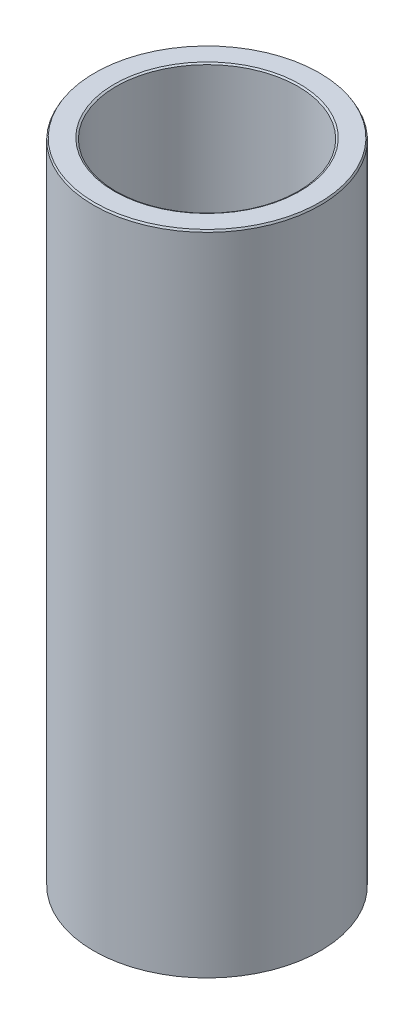
ISO-10303-21;
HEADER;
FILE_DESCRIPTION(('STEP AP214'),'2;1');
FILE_NAME('part.step','',(''),(''),'','','');
FILE_SCHEMA(('AUTOMOTIVE_DESIGN { 1 0 10303 214 1 1 1 1 }'));
ENDSEC;
DATA;
#1=APPLICATION_CONTEXT('core data for automotive mechanical design processes');
#2=APPLICATION_PROTOCOL_DEFINITION('international standard','automotive_design',2000,#1);
#3=PRODUCT_CONTEXT('',#1,'mechanical');
#4=PRODUCT('Part','Part','',(#3));
#5=PRODUCT_RELATED_PRODUCT_CATEGORY('part','',(#4));
#6=PRODUCT_DEFINITION_FORMATION('','',#4);
#7=PRODUCT_DEFINITION_CONTEXT('part definition',#1,'design');
#8=PRODUCT_DEFINITION('design','',#6,#7);
#9=PRODUCT_DEFINITION_SHAPE('','',#8);
#10=(LENGTH_UNIT() NAMED_UNIT(*) SI_UNIT(.MILLI.,.METRE.));
#11=(NAMED_UNIT(*) PLANE_ANGLE_UNIT() SI_UNIT($,.RADIAN.));
#12=(NAMED_UNIT(*) SI_UNIT($,.STERADIAN.) SOLID_ANGLE_UNIT());
#13=UNCERTAINTY_MEASURE_WITH_UNIT(LENGTH_MEASURE(1.E-05),#10,'distance_accuracy_value','');
#14=(GEOMETRIC_REPRESENTATION_CONTEXT(3) GLOBAL_UNCERTAINTY_ASSIGNED_CONTEXT((#13)) GLOBAL_UNIT_ASSIGNED_CONTEXT((#10,
#11,#12)) REPRESENTATION_CONTEXT('',''));
#15=CARTESIAN_POINT('',(0.,0.,0.));
#16=DIRECTION('',(0.,0.,1.));
#17=DIRECTION('',(1.,0.,0.));
#18=AXIS2_PLACEMENT_3D('',#15,#16,#17);
#19=CARTESIAN_POINT('',(0.,228.77688632099,0.));
#20=DIRECTION('',(0.,-1.,0.));
#21=DIRECTION('',(0.,0.,-1.));
#22=AXIS2_PLACEMENT_3D('',#19,#20,#21);
#23=CYLINDRICAL_SURFACE('',#22,40.);
#24=CARTESIAN_POINT('',(0.,0.370162493781384,0.));
#25=DIRECTION('',(0.,1.,0.));
#26=DIRECTION('',(0.,0.,1.));
#27=AXIS2_PLACEMENT_3D('',#24,#25,#26);
#28=CIRCLE('',#27,40.);
#29=CARTESIAN_POINT('',(0.,0.370162493781384,40.));
#30=VERTEX_POINT('',#29);
#31=EDGE_CURVE('E10',#30,#30,#28,.T.);
#32=ORIENTED_EDGE('',*,*,#31,.T.);
#33=EDGE_LOOP('',(#32));
#34=FACE_BOUND('',#33,.T.);
#35=CARTESIAN_POINT('',(0.,228.135746074704,0.));
#36=DIRECTION('',(0.,1.,0.));
#37=DIRECTION('',(0.,0.,1.));
#38=AXIS2_PLACEMENT_3D('',#35,#36,#37);
#39=CIRCLE('',#38,40.);
#40=CARTESIAN_POINT('',(0.,228.135746074704,40.));
#41=VERTEX_POINT('',#40);
#42=EDGE_CURVE('E50',#41,#41,#39,.F.);
#43=ORIENTED_EDGE('',*,*,#42,.T.);
#44=EDGE_LOOP('',(#43));
#45=FACE_BOUND('',#44,.T.);
#46=ADVANCED_FACE('F39',(#34,#45),#23,.T.);
#47=CARTESIAN_POINT('',(0.,228.77688632099,0.));
#48=DIRECTION('',(0.,1.,0.));
#49=DIRECTION('',(0.,0.,1.));
#50=AXIS2_PLACEMENT_3D('',#47,#48,#49);
#51=PLANE('',#50);
#52=CARTESIAN_POINT('',(0.,228.77688632099,0.));
#53=DIRECTION('',(0.,1.,0.));
#54=DIRECTION('',(0.,0.,1.));
#55=AXIS2_PLACEMENT_3D('',#52,#53,#54);
#56=CIRCLE('',#55,32.7370871076893);
#57=CARTESIAN_POINT('',(0.,228.77688632099,32.7370871076893));
#58=VERTEX_POINT('',#57);
#59=EDGE_CURVE('E58',#58,#58,#56,.F.);
#60=ORIENTED_EDGE('',*,*,#59,.T.);
#61=EDGE_LOOP('',(#60));
#62=FACE_BOUND('',#61,.T.);
#63=CARTESIAN_POINT('',(0.,228.77688632099,0.));
#64=DIRECTION('',(0.,1.,0.));
#65=DIRECTION('',(0.,0.,1.));
#66=AXIS2_PLACEMENT_3D('',#63,#64,#65);
#67=CIRCLE('',#66,39.6298375062186);
#68=CARTESIAN_POINT('',(0.,228.77688632099,39.6298375062186));
#69=VERTEX_POINT('',#68);
#70=EDGE_CURVE('E61',#69,#69,#67,.T.);
#71=ORIENTED_EDGE('',*,*,#70,.T.);
#72=EDGE_LOOP('',(#71));
#73=FACE_BOUND('',#72,.T.);
#74=ADVANCED_FACE('F88',(#62,#73),#51,.T.);
#75=CARTESIAN_POINT('',(0.,0.,0.));
#76=DIRECTION('',(0.,1.,0.));
#77=DIRECTION('',(0.,0.,1.));
#78=AXIS2_PLACEMENT_3D('',#75,#76,#77);
#79=PLANE('',#78);
#80=CARTESIAN_POINT('',(0.,0.,0.));
#81=DIRECTION('',(0.,1.,0.));
#82=DIRECTION('',(0.,0.,1.));
#83=AXIS2_PLACEMENT_3D('',#80,#81,#82);
#84=CIRCLE('',#83,32.4661093551849);
#85=CARTESIAN_POINT('',(0.,0.,-32.4661093551849));
#86=VERTEX_POINT('',#85);
#87=EDGE_CURVE('E51',#86,#86,#84,.T.);
#88=ORIENTED_EDGE('',*,*,#87,.T.);
#89=EDGE_LOOP('',(#88));
#90=FACE_BOUND('',#89,.T.);
#91=CARTESIAN_POINT('',(0.,0.,0.));
#92=DIRECTION('',(0.,1.,0.));
#93=DIRECTION('',(0.,0.,1.));
#94=AXIS2_PLACEMENT_3D('',#91,#92,#93);
#95=CIRCLE('',#94,39.3588597537142);
#96=CARTESIAN_POINT('',(0.,0.,39.3588597537142));
#97=VERTEX_POINT('',#96);
#98=EDGE_CURVE('E54',#97,#97,#95,.F.);
#99=ORIENTED_EDGE('',*,*,#98,.T.);
#100=EDGE_LOOP('',(#99));
#101=FACE_BOUND('',#100,.T.);
#102=ADVANCED_FACE('F83',(#90,#101),#79,.F.);
#103=CARTESIAN_POINT('',(0.,228.77688632099,0.));
#104=DIRECTION('',(0.,-1.,0.));
#105=DIRECTION('',(0.,0.,-1.));
#106=AXIS2_PLACEMENT_3D('',#103,#104,#105);
#107=CYLINDRICAL_SURFACE('',#106,32.0959468614035);
#108=CARTESIAN_POINT('',(0.,228.406723827208,0.));
#109=DIRECTION('',(0.,1.,0.));
#110=DIRECTION('',(0.,0.,1.));
#111=AXIS2_PLACEMENT_3D('',#108,#109,#110);
#112=CIRCLE('',#111,32.0959468614035);
#113=CARTESIAN_POINT('',(0.,228.406723827208,32.0959468614035));
#114=VERTEX_POINT('',#113);
#115=EDGE_CURVE('E67',#114,#114,#112,.T.);
#116=ORIENTED_EDGE('',*,*,#115,.T.);
#117=EDGE_LOOP('',(#116));
#118=FACE_BOUND('',#117,.T.);
#119=CARTESIAN_POINT('',(0.,0.64114024628581,0.));
#120=DIRECTION('',(0.,1.,0.));
#121=DIRECTION('',(0.,0.,1.));
#122=AXIS2_PLACEMENT_3D('',#119,#120,#121);
#123=CIRCLE('',#122,32.0959468614035);
#124=CARTESIAN_POINT('',(0.,0.641140246285809,-32.0959468614035));
#125=VERTEX_POINT('',#124);
#126=EDGE_CURVE('E69',#125,#125,#123,.F.);
#127=ORIENTED_EDGE('',*,*,#126,.T.);
#128=EDGE_LOOP('',(#127));
#129=FACE_BOUND('',#128,.T.);
#130=ADVANCED_FACE('F71',(#118,#129),#107,.F.);
#131=CARTESIAN_POINT('',(0.,228.406723827208,0.));
#132=DIRECTION('',(0.,1.,0.));
#133=DIRECTION('',(0.,0.,1.));
#134=AXIS2_PLACEMENT_3D('',#131,#132,#133);
#135=CONICAL_SURFACE('',#134,32.0959468614035,1.04719755119659);
#136=ORIENTED_EDGE('',*,*,#59,.F.);
#137=EDGE_LOOP('',(#136));
#138=FACE_BOUND('',#137,.T.);
#139=ORIENTED_EDGE('',*,*,#115,.F.);
#140=EDGE_LOOP('',(#139));
#141=FACE_BOUND('',#140,.T.);
#142=ADVANCED_FACE('F77',(#138,#141),#135,.F.);
#143=CARTESIAN_POINT('',(0.,0.,0.));
#144=DIRECTION('',(0.,-1.,0.));
#145=DIRECTION('',(0.,0.,-1.));
#146=AXIS2_PLACEMENT_3D('',#143,#144,#145);
#147=CONICAL_SURFACE('',#146,32.4661093551849,0.523598775598303);
#148=CARTESIAN_POINT('',(0.,0.641140246285809,-32.0959468614035));
#149=CARTESIAN_POINT('',(0.,0.634461702053667,-32.0998027207137));
#150=CARTESIAN_POINT('',(0.,0.627783157821523,-32.1036585800239));
#151=CARTESIAN_POINT('',(0.,0.614426069357234,-32.1113702986444));
#152=CARTESIAN_POINT('',(0.,0.60774752512509,-32.1152261579546));
#153=CARTESIAN_POINT('',(0.,0.594390436660802,-32.122937876575));
#154=CARTESIAN_POINT('',(0.,0.587711892428659,-32.1267937358852));
#155=CARTESIAN_POINT('',(0.,0.574354803964371,-32.1345054545057));
#156=CARTESIAN_POINT('',(0.,0.567676259732227,-32.1383613138159));
#157=CARTESIAN_POINT('',(0.,0.554319171267939,-32.1460730324364));
#158=CARTESIAN_POINT('',(0.,0.547640627035796,-32.1499288917466));
#159=CARTESIAN_POINT('',(0.,0.534283538571508,-32.157640610367));
#160=CARTESIAN_POINT('',(0.,0.527604994339364,-32.1614964696772));
#161=CARTESIAN_POINT('',(0.,0.514247905875076,-32.1692081882977));
#162=CARTESIAN_POINT('',(0.,0.507569361642933,-32.1730640476079));
#163=CARTESIAN_POINT('',(0.,0.494212273178645,-32.1807757662284));
#164=CARTESIAN_POINT('',(0.,0.4875337289465,-32.1846316255386));
#165=CARTESIAN_POINT('',(0.,0.474176640482213,-32.192343344159));
#166=CARTESIAN_POINT('',(0.,0.46749809625007,-32.1961992034693));
#167=CARTESIAN_POINT('',(0.,0.454141007785782,-32.2039109220897));
#168=CARTESIAN_POINT('',(0.,0.447462463553637,-32.2077667813999));
#169=CARTESIAN_POINT('',(0.,0.43410537508935,-32.2154785000204));
#170=CARTESIAN_POINT('',(0.,0.427426830857207,-32.2193343593306));
#171=CARTESIAN_POINT('',(0.,0.414069742392919,-32.227046077951));
#172=CARTESIAN_POINT('',(0.,0.407391198160774,-32.2309019372613));
#173=CARTESIAN_POINT('',(0.,0.394034109696487,-32.2386136558817));
#174=CARTESIAN_POINT('',(0.,0.387355565464344,-32.2424695151919));
#175=CARTESIAN_POINT('',(0.,0.373998477000056,-32.2501812338124));
#176=CARTESIAN_POINT('',(0.,0.367319932767911,-32.2540370931226));
#177=CARTESIAN_POINT('',(0.,0.353962844303623,-32.261748811743));
#178=CARTESIAN_POINT('',(0.,0.347284300071481,-32.2656046710533));
#179=CARTESIAN_POINT('',(0.,0.333927211607193,-32.2733163896737));
#180=CARTESIAN_POINT('',(0.,0.327248667375048,-32.2771722489839));
#181=CARTESIAN_POINT('',(0.,0.31389157891076,-32.2848839676044));
#182=CARTESIAN_POINT('',(0.,0.307213034678617,-32.2887398269146));
#183=CARTESIAN_POINT('',(0.,0.29385594621433,-32.2964515455351));
#184=CARTESIAN_POINT('',(0.,0.287177401982186,-32.3003074048453));
#185=CARTESIAN_POINT('',(0.,0.273820313517898,-32.3080191234657));
#186=CARTESIAN_POINT('',(0.,0.267141769285753,-32.3118749827759));
#187=CARTESIAN_POINT('',(0.,0.253784680821466,-32.3195867013964));
#188=CARTESIAN_POINT('',(0.,0.247106136589323,-32.3234425607066));
#189=CARTESIAN_POINT('',(0.,0.233749048125035,-32.3311542793271));
#190=CARTESIAN_POINT('',(0.,0.22707050389289,-32.3350101386373));
#191=CARTESIAN_POINT('',(0.,0.213713415428603,-32.3427218572577));
#192=CARTESIAN_POINT('',(0.,0.20703487119646,-32.346577716568));
#193=CARTESIAN_POINT('',(0.,0.193677782732172,-32.3542894351884));
#194=CARTESIAN_POINT('',(0.,0.186999238500027,-32.3581452944986));
#195=CARTESIAN_POINT('',(0.,0.17364215003574,-32.3658570131191));
#196=CARTESIAN_POINT('',(0.,0.166963605803597,-32.3697128724293));
#197=CARTESIAN_POINT('',(0.,0.153606517339309,-32.3774245910497));
#198=CARTESIAN_POINT('',(0.,0.146927973107164,-32.38128045036));
#199=CARTESIAN_POINT('',(0.,0.133570884642876,-32.3889921689804));
#200=CARTESIAN_POINT('',(0.,0.126892340410734,-32.3928480282906));
#201=CARTESIAN_POINT('',(0.,0.113535251946446,-32.4005597469111));
#202=CARTESIAN_POINT('',(0.,0.106856707714301,-32.4044156062213));
#203=CARTESIAN_POINT('',(0.,0.0934996192500134,-32.4121273248417));
#204=CARTESIAN_POINT('',(0.,0.0868210750178705,-32.415983184152));
#205=CARTESIAN_POINT('',(0.,0.0734639865535828,-32.4236949027724));
#206=CARTESIAN_POINT('',(0.,0.066785442321438,-32.4275507620826));
#207=CARTESIAN_POINT('',(0.,0.0534283538571503,-32.4352624807031));
#208=CARTESIAN_POINT('',(0.,0.0467498096250073,-32.4391183400133));
#209=CARTESIAN_POINT('',(0.,0.0333927211607199,-32.4468300586338));
#210=CARTESIAN_POINT('',(0.,0.0267141769285755,-32.450685917944));
#211=CARTESIAN_POINT('',(0.,0.0133570884642866,-32.4583976365644));
#212=CARTESIAN_POINT('',(0.,0.00667854423214219,-32.4622534958746));
#213=CARTESIAN_POINT('',(0.,0.,-32.4661093551849));
#214=B_SPLINE_CURVE_WITH_KNOTS('',3,(#148,#149,#150,#151,#152,#153,#154,#155,#156,#157,#158,
#159,#160,#161,#162,#163,#164,#165,#166,#167,#168,#169,#170,#171,#172,#173,#174,#175,#176,#177,
#178,#179,#180,#181,#182,#183,#184,#185,#186,#187,#188,#189,#190,#191,#192,#193,#194,#195,#196,
#197,#198,#199,#200,#201,#202,#203,#204,#205,#206,#207,#208,#209,#210,#211,#212,#213),
.UNSPECIFIED.,.F.,.F.,(4,2,2,2,2,2,2,2,2,2,2,2,2,2,2,2,2,2,2,2,2,2,2,2,2,2,2,2,2,2,2,2,4),(0.,
0.0231351558613401,0.0462703117226768,0.0694054675840169,0.0925406234453536,0.115675779306694,
0.13881093516803,0.161946091029371,0.185081246890707,0.208216402752047,0.231351558613384,
0.254486714474724,0.277621870336061,0.300757026197401,0.323892182058738,0.347027337920078,
0.370162493781414,0.393297649642754,0.416432805504095,0.439567961365431,0.462703117226771,
0.485838273088108,0.508973428949448,0.532108584810785,0.555243740672125,0.578378896533461,
0.601514052394801,0.624649208256138,0.647784364117478,0.670919519978815,0.694054675840155,
0.717189831701492,0.740324987562832),.UNSPECIFIED.);
#215=EDGE_CURVE('BSEAM73',#125,#86,#214,.T.);
#216=ORIENTED_EDGE('',*,*,#126,.F.);
#217=ORIENTED_EDGE('',*,*,#87,.F.);
#218=ORIENTED_EDGE('',*,*,#215,.T.);
#219=ORIENTED_EDGE('',*,*,#215,.F.);
#220=EDGE_LOOP('',(#216,#218,#217,#219));
#221=FACE_BOUND('',#220,.T.);
#222=ADVANCED_FACE('F73',(#221),#147,.F.);
#223=CARTESIAN_POINT('',(0.,0.370162493781384,0.));
#224=DIRECTION('',(0.,1.,0.));
#225=DIRECTION('',(0.,0.,1.));
#226=AXIS2_PLACEMENT_3D('',#223,#224,#225);
#227=CONICAL_SURFACE('',#226,40.,1.04719755119663);
#228=ORIENTED_EDGE('',*,*,#98,.F.);
#229=EDGE_LOOP('',(#228));
#230=FACE_BOUND('',#229,.T.);
#231=ORIENTED_EDGE('',*,*,#31,.F.);
#232=EDGE_LOOP('',(#231));
#233=FACE_BOUND('',#232,.T.);
#234=ADVANCED_FACE('F76',(#230,#233),#227,.T.);
#235=CARTESIAN_POINT('',(0.,228.77688632099,0.));
#236=DIRECTION('',(0.,-1.,0.));
#237=DIRECTION('',(0.,0.,-1.));
#238=AXIS2_PLACEMENT_3D('',#235,#236,#237);
#239=CONICAL_SURFACE('',#238,39.6298375062186,0.523598775598301);
#240=ORIENTED_EDGE('',*,*,#42,.F.);
#241=EDGE_LOOP('',(#240));
#242=FACE_BOUND('',#241,.T.);
#243=ORIENTED_EDGE('',*,*,#70,.F.);
#244=EDGE_LOOP('',(#243));
#245=FACE_BOUND('',#244,.T.);
#246=ADVANCED_FACE('F45',(#242,#245),#239,.T.);
#247=CLOSED_SHELL('',(#46,#74,#102,#130,#142,#222,#234,#246));
#248=MANIFOLD_SOLID_BREP('B2',#247);
#249=ADVANCED_BREP_SHAPE_REPRESENTATION('',(#18,#248),#14);
#250=SHAPE_DEFINITION_REPRESENTATION(#9,#249);
ENDSEC;
END-ISO-10303-21;
